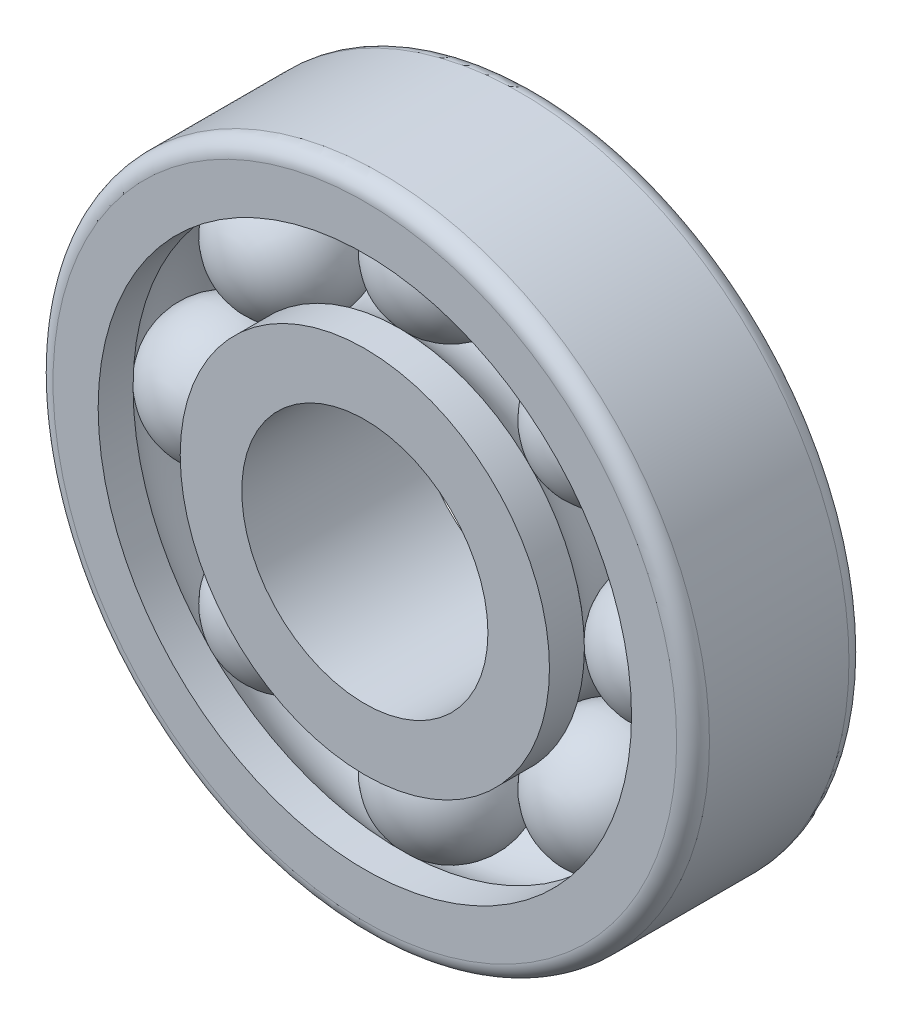
ISO-10303-21;
HEADER;
FILE_DESCRIPTION(('STEP AP214'),'2;1');
FILE_NAME('part.step','',(''),(''),'','','');
FILE_SCHEMA(('AUTOMOTIVE_DESIGN { 1 0 10303 214 1 1 1 1 }'));
ENDSEC;
DATA;
#1=APPLICATION_CONTEXT('core data for automotive mechanical design processes');
#2=APPLICATION_PROTOCOL_DEFINITION('international standard','automotive_design',2000,#1);
#3=PRODUCT_CONTEXT('',#1,'mechanical');
#4=PRODUCT('Part','Part','',(#3));
#5=PRODUCT_RELATED_PRODUCT_CATEGORY('part','',(#4));
#6=PRODUCT_DEFINITION_FORMATION('','',#4);
#7=PRODUCT_DEFINITION_CONTEXT('part definition',#1,'design');
#8=PRODUCT_DEFINITION('design','',#6,#7);
#9=PRODUCT_DEFINITION_SHAPE('','',#8);
#10=(LENGTH_UNIT() NAMED_UNIT(*) SI_UNIT(.MILLI.,.METRE.));
#11=(NAMED_UNIT(*) PLANE_ANGLE_UNIT() SI_UNIT($,.RADIAN.));
#12=(NAMED_UNIT(*) SI_UNIT($,.STERADIAN.) SOLID_ANGLE_UNIT());
#13=UNCERTAINTY_MEASURE_WITH_UNIT(LENGTH_MEASURE(1.E-05),#10,'distance_accuracy_value','');
#14=(GEOMETRIC_REPRESENTATION_CONTEXT(3) GLOBAL_UNCERTAINTY_ASSIGNED_CONTEXT((#13)) GLOBAL_UNIT_ASSIGNED_CONTEXT((#10,
#11,#12)) REPRESENTATION_CONTEXT('',''));
#15=CARTESIAN_POINT('',(0.,0.,0.));
#16=DIRECTION('',(0.,0.,1.));
#17=DIRECTION('',(1.,0.,0.));
#18=AXIS2_PLACEMENT_3D('',#15,#16,#17);
#19=CARTESIAN_POINT('',(19.4454364826303,-19.4454364826298,10.5));
#20=DIRECTION('',(0.,0.,-1.));
#21=DIRECTION('',(0.707106781186556,-0.707106781186539,0.));
#22=AXIS2_PLACEMENT_3D('',#19,#20,#21);
#23=SPHERICAL_SURFACE('',#22,8.);
#24=CARTESIAN_POINT('',(19.4454364826303,-19.4454364826298,2.50000000000001));
#25=VERTEX_POINT('',#24);
#26=VERTEX_LOOP('',#25);
#27=FACE_BOUND('',#26,.T.);
#28=ADVANCED_FACE('F54',(#27),#23,.T.);
#29=CLOSED_SHELL('',(#28));
#30=MANIFOLD_SOLID_BREP('B2',#29);
#31=CARTESIAN_POINT('',(2.88047210454559E-13,-27.5,10.5));
#32=DIRECTION('',(0.,0.,-1.));
#33=DIRECTION('',(0.,-1.,0.));
#34=AXIS2_PLACEMENT_3D('',#31,#32,#33);
#35=SPHERICAL_SURFACE('',#34,8.);
#36=CARTESIAN_POINT('',(2.88047210454559E-13,-27.5,2.50000000000001));
#37=VERTEX_POINT('',#36);
#38=VERTEX_LOOP('',#37);
#39=FACE_BOUND('',#38,.T.);
#40=ADVANCED_FACE('F75',(#39),#35,.T.);
#41=CLOSED_SHELL('',(#40));
#42=MANIFOLD_SOLID_BREP('B7',#41);
#43=CARTESIAN_POINT('',(-19.4454364826299,-19.4454364826302,10.5));
#44=DIRECTION('',(0.,0.,-1.));
#45=DIRECTION('',(-0.707106781186541,-0.707106781186554,0.));
#46=AXIS2_PLACEMENT_3D('',#43,#44,#45);
#47=SPHERICAL_SURFACE('',#46,8.);
#48=CARTESIAN_POINT('',(-19.4454364826299,-19.4454364826302,2.50000000000001));
#49=VERTEX_POINT('',#48);
#50=VERTEX_LOOP('',#49);
#51=FACE_BOUND('',#50,.T.);
#52=ADVANCED_FACE('F96',(#51),#47,.T.);
#53=CLOSED_SHELL('',(#52));
#54=MANIFOLD_SOLID_BREP('B50',#53);
#55=CARTESIAN_POINT('',(-27.5,0.,10.5));
#56=DIRECTION('',(0.,0.,-1.));
#57=DIRECTION('',(-1.,0.,0.));
#58=AXIS2_PLACEMENT_3D('',#55,#56,#57);
#59=SPHERICAL_SURFACE('',#58,8.);
#60=CARTESIAN_POINT('',(-27.5,0.,2.50000000000001));
#61=VERTEX_POINT('',#60);
#62=VERTEX_LOOP('',#61);
#63=FACE_BOUND('',#62,.T.);
#64=ADVANCED_FACE('F117',(#63),#59,.T.);
#65=CLOSED_SHELL('',(#64));
#66=MANIFOLD_SOLID_BREP('B71',#65);
#67=CARTESIAN_POINT('',(-19.4454364826302,19.44543648263,10.5));
#68=DIRECTION('',(0.,0.,-1.));
#69=DIRECTION('',(-0.707106781186551,0.707106781186544,0.));
#70=AXIS2_PLACEMENT_3D('',#67,#68,#69);
#71=SPHERICAL_SURFACE('',#70,8.);
#72=CARTESIAN_POINT('',(-19.4454364826302,19.44543648263,2.50000000000001));
#73=VERTEX_POINT('',#72);
#74=VERTEX_LOOP('',#73);
#75=FACE_BOUND('',#74,.T.);
#76=ADVANCED_FACE('F138',(#75),#71,.T.);
#77=CLOSED_SHELL('',(#76));
#78=MANIFOLD_SOLID_BREP('B92',#77);
#79=CARTESIAN_POINT('',(0.,27.5,10.5));
#80=DIRECTION('',(0.,0.,-1.));
#81=DIRECTION('',(0.,1.,0.));
#82=AXIS2_PLACEMENT_3D('',#79,#80,#81);
#83=SPHERICAL_SURFACE('',#82,8.);
#84=CARTESIAN_POINT('',(0.,27.5,2.50000000000001));
#85=VERTEX_POINT('',#84);
#86=VERTEX_LOOP('',#85);
#87=FACE_BOUND('',#86,.T.);
#88=ADVANCED_FACE('F159',(#87),#83,.T.);
#89=CLOSED_SHELL('',(#88));
#90=MANIFOLD_SOLID_BREP('B113',#89);
#91=CARTESIAN_POINT('',(19.44543648263,19.4454364826301,10.5));
#92=DIRECTION('',(0.,0.,-1.));
#93=DIRECTION('',(0.707106781186546,0.707106781186549,0.));
#94=AXIS2_PLACEMENT_3D('',#91,#92,#93);
#95=SPHERICAL_SURFACE('',#94,8.);
#96=CARTESIAN_POINT('',(19.44543648263,19.4454364826301,2.50000000000001));
#97=VERTEX_POINT('',#96);
#98=VERTEX_LOOP('',#97);
#99=FACE_BOUND('',#98,.T.);
#100=ADVANCED_FACE('F180',(#99),#95,.T.);
#101=CLOSED_SHELL('',(#100));
#102=MANIFOLD_SOLID_BREP('B134',#101);
#103=CARTESIAN_POINT('',(27.5,0.,10.5));
#104=DIRECTION('',(0.,0.,-1.));
#105=DIRECTION('',(1.,0.,0.));
#106=AXIS2_PLACEMENT_3D('',#103,#104,#105);
#107=SPHERICAL_SURFACE('',#106,8.);
#108=CARTESIAN_POINT('',(27.5,0.,2.50000000000001));
#109=VERTEX_POINT('',#108);
#110=VERTEX_LOOP('',#109);
#111=FACE_BOUND('',#110,.T.);
#112=ADVANCED_FACE('F203',(#111),#107,.T.);
#113=CLOSED_SHELL('',(#112));
#114=MANIFOLD_SOLID_BREP('B155',#113);
#115=CARTESIAN_POINT('',(0.,0.,21.));
#116=DIRECTION('',(0.,0.,-1.));
#117=DIRECTION('',(-1.,0.,0.));
#118=AXIS2_PLACEMENT_3D('',#115,#116,#117);
#119=CYLINDRICAL_SURFACE('',#118,22.5);
#120=CARTESIAN_POINT('',(0.,0.,16.7449979983984));
#121=DIRECTION('',(0.,0.,-1.));
#122=DIRECTION('',(-1.,0.,0.));
#123=AXIS2_PLACEMENT_3D('',#120,#121,#122);
#124=CIRCLE('',#123,22.5);
#125=CARTESIAN_POINT('',(-22.5,0.,16.7449979983984));
#126=VERTEX_POINT('',#125);
#127=EDGE_CURVE('E229',#126,#126,#124,.F.);
#128=ORIENTED_EDGE('',*,*,#127,.T.);
#129=EDGE_LOOP('',(#128));
#130=FACE_BOUND('',#129,.T.);
#131=CARTESIAN_POINT('',(0.,0.,21.));
#132=DIRECTION('',(0.,0.,1.));
#133=DIRECTION('',(1.,0.,0.));
#134=AXIS2_PLACEMENT_3D('',#131,#132,#133);
#135=CIRCLE('',#134,22.5);
#136=CARTESIAN_POINT('',(22.5,0.,21.));
#137=VERTEX_POINT('',#136);
#138=EDGE_CURVE('E202',#137,#137,#135,.T.);
#139=ORIENTED_EDGE('',*,*,#138,.F.);
#140=EDGE_LOOP('',(#139));
#141=FACE_BOUND('',#140,.T.);
#142=ADVANCED_FACE('F225',(#130,#141),#119,.T.);
#143=CARTESIAN_POINT('',(0.,0.,21.));
#144=DIRECTION('',(0.,0.,-1.));
#145=DIRECTION('',(-1.,0.,0.));
#146=AXIS2_PLACEMENT_3D('',#143,#144,#145);
#147=CYLINDRICAL_SURFACE('',#146,15.);
#148=CARTESIAN_POINT('',(0.,0.,21.));
#149=DIRECTION('',(0.,0.,1.));
#150=DIRECTION('',(1.,0.,0.));
#151=AXIS2_PLACEMENT_3D('',#148,#149,#150);
#152=CIRCLE('',#151,15.);
#153=CARTESIAN_POINT('',(15.,0.,21.));
#154=VERTEX_POINT('',#153);
#155=EDGE_CURVE('E233',#154,#154,#152,.T.);
#156=ORIENTED_EDGE('',*,*,#155,.T.);
#157=EDGE_LOOP('',(#156));
#158=FACE_BOUND('',#157,.T.);
#159=CARTESIAN_POINT('',(0.,0.,0.));
#160=DIRECTION('',(0.,0.,1.));
#161=DIRECTION('',(1.,0.,0.));
#162=AXIS2_PLACEMENT_3D('',#159,#160,#161);
#163=CIRCLE('',#162,15.);
#164=CARTESIAN_POINT('',(15.,0.,0.));
#165=VERTEX_POINT('',#164);
#166=EDGE_CURVE('E241',#165,#165,#163,.T.);
#167=ORIENTED_EDGE('',*,*,#166,.F.);
#168=EDGE_LOOP('',(#167));
#169=FACE_BOUND('',#168,.T.);
#170=ADVANCED_FACE('F227',(#158,#169),#147,.F.);
#171=CARTESIAN_POINT('',(0.,0.,4.25500200160161));
#172=DIRECTION('',(0.,0.,1.));
#173=DIRECTION('',(1.,0.,0.));
#174=AXIS2_PLACEMENT_3D('',#171,#172,#173);
#175=CIRCLE('',#174,22.5);
#176=CARTESIAN_POINT('',(22.5,0.,4.25500200160161));
#177=VERTEX_POINT('',#176);
#178=EDGE_CURVE('E245',#177,#177,#175,.F.);
#179=ORIENTED_EDGE('',*,*,#178,.T.);
#180=EDGE_LOOP('',(#179));
#181=FACE_BOUND('',#180,.T.);
#182=CARTESIAN_POINT('',(0.,0.,0.));
#183=DIRECTION('',(0.,0.,1.));
#184=DIRECTION('',(1.,0.,0.));
#185=AXIS2_PLACEMENT_3D('',#182,#183,#184);
#186=CIRCLE('',#185,22.5);
#187=CARTESIAN_POINT('',(22.5,0.,0.));
#188=VERTEX_POINT('',#187);
#189=EDGE_CURVE('E238',#188,#188,#186,.T.);
#190=ORIENTED_EDGE('',*,*,#189,.T.);
#191=EDGE_LOOP('',(#190));
#192=FACE_BOUND('',#191,.T.);
#193=ADVANCED_FACE('F267',(#181,#192),#119,.T.);
#194=CARTESIAN_POINT('',(0.,0.,21.));
#195=DIRECTION('',(0.,0.,1.));
#196=DIRECTION('',(1.,0.,0.));
#197=AXIS2_PLACEMENT_3D('',#194,#195,#196);
#198=PLANE('',#197);
#199=ORIENTED_EDGE('',*,*,#155,.F.);
#200=EDGE_LOOP('',(#199));
#201=FACE_BOUND('',#200,.T.);
#202=ORIENTED_EDGE('',*,*,#138,.T.);
#203=EDGE_LOOP('',(#202));
#204=FACE_BOUND('',#203,.T.);
#205=ADVANCED_FACE('F262',(#201,#204),#198,.T.);
#206=CARTESIAN_POINT('',(0.,0.,0.));
#207=DIRECTION('',(0.,0.,1.));
#208=DIRECTION('',(1.,0.,0.));
#209=AXIS2_PLACEMENT_3D('',#206,#207,#208);
#210=PLANE('',#209);
#211=ORIENTED_EDGE('',*,*,#166,.T.);
#212=EDGE_LOOP('',(#211));
#213=FACE_BOUND('',#212,.T.);
#214=ORIENTED_EDGE('',*,*,#189,.F.);
#215=EDGE_LOOP('',(#214));
#216=FACE_BOUND('',#215,.T.);
#217=ADVANCED_FACE('F256',(#213,#216),#210,.F.);
#218=CARTESIAN_POINT('',(0.,0.,10.5));
#219=DIRECTION('',(0.,0.,1.));
#220=DIRECTION('',(1.,0.,0.));
#221=AXIS2_PLACEMENT_3D('',#218,#219,#220);
#222=TOROIDAL_SURFACE('',#221,27.5,8.);
#223=ORIENTED_EDGE('',*,*,#178,.F.);
#224=EDGE_LOOP('',(#223));
#225=FACE_BOUND('',#224,.T.);
#226=ORIENTED_EDGE('',*,*,#127,.F.);
#227=EDGE_LOOP('',(#226));
#228=FACE_BOUND('',#227,.T.);
#229=ADVANCED_FACE('F254',(#225,#228),#222,.F.);
#230=CLOSED_SHELL('',(#142,#170,#193,#205,#217,#229));
#231=MANIFOLD_SOLID_BREP('B176',#230);
#232=CARTESIAN_POINT('',(0.,0.,21.));
#233=DIRECTION('',(0.,0.,-1.));
#234=DIRECTION('',(-1.,0.,0.));
#235=AXIS2_PLACEMENT_3D('',#232,#233,#234);
#236=CYLINDRICAL_SURFACE('',#235,32.5);
#237=CARTESIAN_POINT('',(0.,0.,16.7449979983984));
#238=DIRECTION('',(0.,0.,-1.));
#239=DIRECTION('',(-1.,0.,0.));
#240=AXIS2_PLACEMENT_3D('',#237,#238,#239);
#241=CIRCLE('',#240,32.5);
#242=CARTESIAN_POINT('',(-32.5,0.,16.7449979983984));
#243=VERTEX_POINT('',#242);
#244=EDGE_CURVE('E353',#243,#243,#241,.F.);
#245=ORIENTED_EDGE('',*,*,#244,.F.);
#246=EDGE_LOOP('',(#245));
#247=FACE_BOUND('',#246,.T.);
#248=CARTESIAN_POINT('',(0.,0.,21.));
#249=DIRECTION('',(0.,0.,1.));
#250=DIRECTION('',(1.,0.,0.));
#251=AXIS2_PLACEMENT_3D('',#248,#249,#250);
#252=CIRCLE('',#251,32.5);
#253=CARTESIAN_POINT('',(32.5,0.,21.));
#254=VERTEX_POINT('',#253);
#255=EDGE_CURVE('E352',#254,#254,#252,.T.);
#256=ORIENTED_EDGE('',*,*,#255,.T.);
#257=EDGE_LOOP('',(#256));
#258=FACE_BOUND('',#257,.T.);
#259=ADVANCED_FACE('F328',(#247,#258),#236,.F.);
#260=CARTESIAN_POINT('',(0.,0.,4.25500200160161));
#261=DIRECTION('',(0.,0.,1.));
#262=DIRECTION('',(1.,0.,0.));
#263=AXIS2_PLACEMENT_3D('',#260,#261,#262);
#264=CIRCLE('',#263,32.5);
#265=CARTESIAN_POINT('',(32.5,0.,4.25500200160161));
#266=VERTEX_POINT('',#265);
#267=EDGE_CURVE('E358',#266,#266,#264,.F.);
#268=ORIENTED_EDGE('',*,*,#267,.F.);
#269=EDGE_LOOP('',(#268));
#270=FACE_BOUND('',#269,.T.);
#271=CARTESIAN_POINT('',(0.,0.,0.));
#272=DIRECTION('',(0.,0.,1.));
#273=DIRECTION('',(1.,0.,0.));
#274=AXIS2_PLACEMENT_3D('',#271,#272,#273);
#275=CIRCLE('',#274,32.5);
#276=CARTESIAN_POINT('',(32.5,0.,0.));
#277=VERTEX_POINT('',#276);
#278=EDGE_CURVE('E357',#277,#277,#275,.T.);
#279=ORIENTED_EDGE('',*,*,#278,.F.);
#280=EDGE_LOOP('',(#279));
#281=FACE_BOUND('',#280,.T.);
#282=ADVANCED_FACE('F382',(#270,#281),#236,.F.);
#283=CARTESIAN_POINT('',(0.,0.,21.));
#284=DIRECTION('',(0.,0.,-1.));
#285=DIRECTION('',(-1.,0.,0.));
#286=AXIS2_PLACEMENT_3D('',#283,#284,#285);
#287=CYLINDRICAL_SURFACE('',#286,40.);
#288=CARTESIAN_POINT('',(0.,0.,19.));
#289=DIRECTION('',(0.,0.,1.));
#290=DIRECTION('',(1.,0.,0.));
#291=AXIS2_PLACEMENT_3D('',#288,#289,#290);
#292=CIRCLE('',#291,40.);
#293=CARTESIAN_POINT('',(40.,0.,19.));
#294=VERTEX_POINT('',#293);
#295=EDGE_CURVE('E336',#294,#294,#292,.F.);
#296=ORIENTED_EDGE('',*,*,#295,.T.);
#297=EDGE_LOOP('',(#296));
#298=FACE_BOUND('',#297,.T.);
#299=CARTESIAN_POINT('',(0.,0.,2.));
#300=DIRECTION('',(0.,0.,1.));
#301=DIRECTION('',(1.,0.,0.));
#302=AXIS2_PLACEMENT_3D('',#299,#300,#301);
#303=CIRCLE('',#302,40.);
#304=CARTESIAN_POINT('',(40.,0.,2.));
#305=VERTEX_POINT('',#304);
#306=EDGE_CURVE('E341',#305,#305,#303,.T.);
#307=ORIENTED_EDGE('',*,*,#306,.T.);
#308=EDGE_LOOP('',(#307));
#309=FACE_BOUND('',#308,.T.);
#310=ADVANCED_FACE('F373',(#298,#309),#287,.T.);
#311=CARTESIAN_POINT('',(0.,0.,21.));
#312=DIRECTION('',(0.,0.,1.));
#313=DIRECTION('',(1.,0.,0.));
#314=AXIS2_PLACEMENT_3D('',#311,#312,#313);
#315=PLANE('',#314);
#316=CARTESIAN_POINT('',(0.,0.,21.));
#317=DIRECTION('',(0.,0.,1.));
#318=DIRECTION('',(1.,0.,0.));
#319=AXIS2_PLACEMENT_3D('',#316,#317,#318);
#320=CIRCLE('',#319,38.);
#321=CARTESIAN_POINT('',(38.,0.,21.));
#322=VERTEX_POINT('',#321);
#323=EDGE_CURVE('E346',#322,#322,#320,.T.);
#324=ORIENTED_EDGE('',*,*,#323,.T.);
#325=EDGE_LOOP('',(#324));
#326=FACE_BOUND('',#325,.T.);
#327=ORIENTED_EDGE('',*,*,#255,.F.);
#328=EDGE_LOOP('',(#327));
#329=FACE_BOUND('',#328,.T.);
#330=ADVANCED_FACE('F370',(#326,#329),#315,.T.);
#331=CARTESIAN_POINT('',(0.,0.,0.));
#332=DIRECTION('',(0.,0.,1.));
#333=DIRECTION('',(1.,0.,0.));
#334=AXIS2_PLACEMENT_3D('',#331,#332,#333);
#335=PLANE('',#334);
#336=CARTESIAN_POINT('',(0.,0.,0.));
#337=DIRECTION('',(0.,0.,1.));
#338=DIRECTION('',(1.,0.,0.));
#339=AXIS2_PLACEMENT_3D('',#336,#337,#338);
#340=CIRCLE('',#339,38.);
#341=CARTESIAN_POINT('',(38.,0.,0.));
#342=VERTEX_POINT('',#341);
#343=EDGE_CURVE('E224',#342,#342,#340,.F.);
#344=ORIENTED_EDGE('',*,*,#343,.T.);
#345=EDGE_LOOP('',(#344));
#346=FACE_BOUND('',#345,.T.);
#347=ORIENTED_EDGE('',*,*,#278,.T.);
#348=EDGE_LOOP('',(#347));
#349=FACE_BOUND('',#348,.T.);
#350=ADVANCED_FACE('F372',(#346,#349),#335,.F.);
#351=CARTESIAN_POINT('',(0.,0.,10.5));
#352=DIRECTION('',(0.,0.,1.));
#353=DIRECTION('',(1.,0.,0.));
#354=AXIS2_PLACEMENT_3D('',#351,#352,#353);
#355=TOROIDAL_SURFACE('',#354,27.5,8.);
#356=ORIENTED_EDGE('',*,*,#244,.T.);
#357=EDGE_LOOP('',(#356));
#358=FACE_BOUND('',#357,.T.);
#359=ORIENTED_EDGE('',*,*,#267,.T.);
#360=EDGE_LOOP('',(#359));
#361=FACE_BOUND('',#360,.T.);
#362=ADVANCED_FACE('F380',(#358,#361),#355,.F.);
#363=CARTESIAN_POINT('',(0.,0.,19.));
#364=DIRECTION('',(0.,0.,1.));
#365=DIRECTION('',(1.,0.,0.));
#366=AXIS2_PLACEMENT_3D('',#363,#364,#365);
#367=TOROIDAL_SURFACE('',#366,38.,2.);
#368=ORIENTED_EDGE('',*,*,#295,.F.);
#369=EDGE_LOOP('',(#368));
#370=FACE_BOUND('',#369,.T.);
#371=ORIENTED_EDGE('',*,*,#323,.F.);
#372=EDGE_LOOP('',(#371));
#373=FACE_BOUND('',#372,.T.);
#374=ADVANCED_FACE('F393',(#370,#373),#367,.T.);
#375=CARTESIAN_POINT('',(0.,0.,2.));
#376=DIRECTION('',(0.,0.,1.));
#377=DIRECTION('',(1.,0.,0.));
#378=AXIS2_PLACEMENT_3D('',#375,#376,#377);
#379=TOROIDAL_SURFACE('',#378,38.,2.);
#380=ORIENTED_EDGE('',*,*,#343,.F.);
#381=EDGE_LOOP('',(#380));
#382=FACE_BOUND('',#381,.T.);
#383=ORIENTED_EDGE('',*,*,#306,.F.);
#384=EDGE_LOOP('',(#383));
#385=FACE_BOUND('',#384,.T.);
#386=ADVANCED_FACE('F330',(#382,#385),#379,.T.);
#387=CLOSED_SHELL('',(#259,#282,#310,#330,#350,#362,#374,#386));
#388=MANIFOLD_SOLID_BREP('B197',#387);
#389=ADVANCED_BREP_SHAPE_REPRESENTATION('',(#18,#30,#42,#54,#66,#78,#90,#102,#114,#231,#388),#14);
#390=SHAPE_DEFINITION_REPRESENTATION(#9,#389);
ENDSEC;
END-ISO-10303-21;
